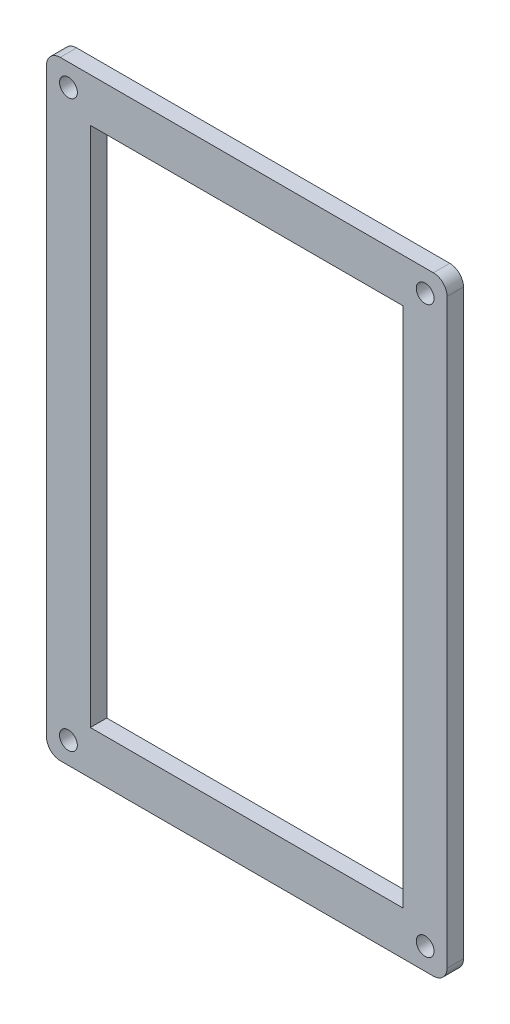
ISO-10303-21;
HEADER;
FILE_DESCRIPTION(('STEP AP214'),'2;1');
FILE_NAME('part.step','',(''),(''),'','','');
FILE_SCHEMA(('AUTOMOTIVE_DESIGN { 1 0 10303 214 1 1 1 1 }'));
ENDSEC;
DATA;
#1=APPLICATION_CONTEXT('core data for automotive mechanical design processes');
#2=APPLICATION_PROTOCOL_DEFINITION('international standard','automotive_design',2000,#1);
#3=PRODUCT_CONTEXT('',#1,'mechanical');
#4=PRODUCT('Part','Part','',(#3));
#5=PRODUCT_RELATED_PRODUCT_CATEGORY('part','',(#4));
#6=PRODUCT_DEFINITION_FORMATION('','',#4);
#7=PRODUCT_DEFINITION_CONTEXT('part definition',#1,'design');
#8=PRODUCT_DEFINITION('design','',#6,#7);
#9=PRODUCT_DEFINITION_SHAPE('','',#8);
#10=(LENGTH_UNIT() NAMED_UNIT(*) SI_UNIT(.MILLI.,.METRE.));
#11=(NAMED_UNIT(*) PLANE_ANGLE_UNIT() SI_UNIT($,.RADIAN.));
#12=(NAMED_UNIT(*) SI_UNIT($,.STERADIAN.) SOLID_ANGLE_UNIT());
#13=UNCERTAINTY_MEASURE_WITH_UNIT(LENGTH_MEASURE(1.E-05),#10,'distance_accuracy_value','');
#14=(GEOMETRIC_REPRESENTATION_CONTEXT(3) GLOBAL_UNCERTAINTY_ASSIGNED_CONTEXT((#13)) GLOBAL_UNIT_ASSIGNED_CONTEXT((#10,
#11,#12)) REPRESENTATION_CONTEXT('',''));
#15=CARTESIAN_POINT('',(0.,0.,0.));
#16=DIRECTION('',(0.,0.,1.));
#17=DIRECTION('',(1.,0.,0.));
#18=AXIS2_PLACEMENT_3D('',#15,#16,#17);
#19=CARTESIAN_POINT('',(0.,111.260961871699,3.));
#20=DIRECTION('',(0.,-1.,0.));
#21=DIRECTION('',(0.,0.,-1.));
#22=AXIS2_PLACEMENT_3D('',#19,#20,#21);
#23=PLANE('',#22);
#24=DIRECTION('',(-1.,0.,0.));
#25=VECTOR('',#24,1.);
#26=CARTESIAN_POINT('',(0.,111.260961871699,0.));
#27=LINE('',#26,#25);
#28=CARTESIAN_POINT('',(70.6730630130925,111.260961871699,0.));
#29=VERTEX_POINT('',#28);
#30=CARTESIAN_POINT('',(2.52284761309159,111.260961871699,0.));
#31=VERTEX_POINT('',#30);
#32=EDGE_CURVE('E179',#29,#31,#27,.T.);
#33=ORIENTED_EDGE('',*,*,#32,.T.);
#34=DIRECTION('',(0.,0.,-1.));
#35=VECTOR('',#34,1.);
#36=CARTESIAN_POINT('',(2.52284761309159,111.260961871699,3.));
#37=LINE('',#36,#35);
#38=CARTESIAN_POINT('',(2.52284761309159,111.260961871699,3.));
#39=VERTEX_POINT('',#38);
#40=EDGE_CURVE('E11',#39,#31,#37,.T.);
#41=ORIENTED_EDGE('',*,*,#40,.F.);
#42=DIRECTION('',(-1.,0.,0.));
#43=VECTOR('',#42,1.);
#44=CARTESIAN_POINT('',(0.,111.260961871699,3.));
#45=LINE('',#44,#43);
#46=CARTESIAN_POINT('',(70.6730630130925,111.260961871699,3.));
#47=VERTEX_POINT('',#46);
#48=EDGE_CURVE('E234',#47,#39,#45,.T.);
#49=ORIENTED_EDGE('',*,*,#48,.F.);
#50=DIRECTION('',(0.,0.,-1.));
#51=VECTOR('',#50,1.);
#52=CARTESIAN_POINT('',(70.6730630130925,111.260961871699,3.));
#53=LINE('',#52,#51);
#54=EDGE_CURVE('E199',#47,#29,#53,.T.);
#55=ORIENTED_EDGE('',*,*,#54,.T.);
#56=EDGE_LOOP('',(#33,#41,#49,#55));
#57=FACE_BOUND('',#56,.T.);
#58=ADVANCED_FACE('F33',(#57),#23,.F.);
#59=CARTESIAN_POINT('',(2.52284761309159,108.760961871699,3.));
#60=DIRECTION('',(0.,0.,-1.));
#61=DIRECTION('',(-1.,0.,0.));
#62=AXIS2_PLACEMENT_3D('',#59,#60,#61);
#63=CYLINDRICAL_SURFACE('',#62,2.5);
#64=CARTESIAN_POINT('',(2.52284761309159,108.760961871699,0.));
#65=DIRECTION('',(0.,0.,1.));
#66=DIRECTION('',(1.,0.,0.));
#67=AXIS2_PLACEMENT_3D('',#64,#65,#66);
#68=CIRCLE('',#67,2.5);
#69=CARTESIAN_POINT('',(0.0228476130915918,108.760961871699,0.));
#70=VERTEX_POINT('',#69);
#71=EDGE_CURVE('E182',#31,#70,#68,.T.);
#72=ORIENTED_EDGE('',*,*,#71,.T.);
#73=DIRECTION('',(0.,0.,-1.));
#74=VECTOR('',#73,1.);
#75=CARTESIAN_POINT('',(0.0228476130915918,108.760961871699,3.));
#76=LINE('',#75,#74);
#77=CARTESIAN_POINT('',(0.0228476130915918,108.760961871699,3.));
#78=VERTEX_POINT('',#77);
#79=EDGE_CURVE('E43',#78,#70,#76,.T.);
#80=ORIENTED_EDGE('',*,*,#79,.F.);
#81=CARTESIAN_POINT('',(2.52284761309159,108.760961871699,3.));
#82=DIRECTION('',(0.,0.,1.));
#83=DIRECTION('',(1.,0.,0.));
#84=AXIS2_PLACEMENT_3D('',#81,#82,#83);
#85=CIRCLE('',#84,2.5);
#86=EDGE_CURVE('E242',#39,#78,#85,.T.);
#87=ORIENTED_EDGE('',*,*,#86,.F.);
#88=ORIENTED_EDGE('',*,*,#40,.T.);
#89=EDGE_LOOP('',(#72,#80,#87,#88));
#90=FACE_BOUND('',#89,.T.);
#91=ADVANCED_FACE('F271',(#90),#63,.T.);
#92=CARTESIAN_POINT('',(0.0228476130915846,0.,3.));
#93=DIRECTION('',(-1.,0.,0.));
#94=DIRECTION('',(0.,-1.,0.));
#95=AXIS2_PLACEMENT_3D('',#92,#93,#94);
#96=PLANE('',#95);
#97=DIRECTION('',(0.,1.,0.));
#98=VECTOR('',#97,1.);
#99=CARTESIAN_POINT('',(0.0228476130915846,0.,0.));
#100=LINE('',#99,#98);
#101=CARTESIAN_POINT('',(0.0228476130915851,2.51115487169858,0.));
#102=VERTEX_POINT('',#101);
#103=EDGE_CURVE('E185',#102,#70,#100,.T.);
#104=ORIENTED_EDGE('',*,*,#103,.F.);
#105=DIRECTION('',(0.,0.,-1.));
#106=VECTOR('',#105,1.);
#107=CARTESIAN_POINT('',(0.0228476130915851,2.51115487169858,3.));
#108=LINE('',#107,#106);
#109=CARTESIAN_POINT('',(0.0228476130915851,2.51115487169858,3.));
#110=VERTEX_POINT('',#109);
#111=EDGE_CURVE('E205',#110,#102,#108,.T.);
#112=ORIENTED_EDGE('',*,*,#111,.F.);
#113=DIRECTION('',(0.,1.,0.));
#114=VECTOR('',#113,1.);
#115=CARTESIAN_POINT('',(0.0228476130915846,0.,3.));
#116=LINE('',#115,#114);
#117=EDGE_CURVE('E244',#110,#78,#116,.T.);
#118=ORIENTED_EDGE('',*,*,#117,.T.);
#119=ORIENTED_EDGE('',*,*,#79,.T.);
#120=EDGE_LOOP('',(#104,#112,#118,#119));
#121=FACE_BOUND('',#120,.T.);
#122=ADVANCED_FACE('F276',(#121),#96,.T.);
#123=CARTESIAN_POINT('',(2.52284761309159,2.51115487169858,3.));
#124=DIRECTION('',(0.,0.,-1.));
#125=DIRECTION('',(-1.,0.,0.));
#126=AXIS2_PLACEMENT_3D('',#123,#124,#125);
#127=CYLINDRICAL_SURFACE('',#126,2.5);
#128=CARTESIAN_POINT('',(2.52284761309159,2.51115487169858,0.));
#129=DIRECTION('',(0.,0.,1.));
#130=DIRECTION('',(1.,0.,0.));
#131=AXIS2_PLACEMENT_3D('',#128,#129,#130);
#132=CIRCLE('',#131,2.5);
#133=CARTESIAN_POINT('',(2.52284761309159,0.0111548716985808,0.));
#134=VERTEX_POINT('',#133);
#135=EDGE_CURVE('E188',#102,#134,#132,.T.);
#136=ORIENTED_EDGE('',*,*,#135,.T.);
#137=DIRECTION('',(0.,0.,-1.));
#138=VECTOR('',#137,1.);
#139=CARTESIAN_POINT('',(2.52284761309159,0.0111548716985808,3.));
#140=LINE('',#139,#138);
#141=CARTESIAN_POINT('',(2.52284761309159,0.0111548716985808,3.));
#142=VERTEX_POINT('',#141);
#143=EDGE_CURVE('E203',#142,#134,#140,.T.);
#144=ORIENTED_EDGE('',*,*,#143,.F.);
#145=CARTESIAN_POINT('',(2.52284761309159,2.51115487169858,3.));
#146=DIRECTION('',(0.,0.,1.));
#147=DIRECTION('',(1.,0.,0.));
#148=AXIS2_PLACEMENT_3D('',#145,#146,#147);
#149=CIRCLE('',#148,2.5);
#150=EDGE_CURVE('E247',#110,#142,#149,.T.);
#151=ORIENTED_EDGE('',*,*,#150,.F.);
#152=ORIENTED_EDGE('',*,*,#111,.T.);
#153=EDGE_LOOP('',(#136,#144,#151,#152));
#154=FACE_BOUND('',#153,.T.);
#155=ADVANCED_FACE('F397',(#154),#127,.T.);
#156=CARTESIAN_POINT('',(0.,0.011154871698581,3.));
#157=DIRECTION('',(0.,-1.,0.));
#158=DIRECTION('',(1.,0.,0.));
#159=AXIS2_PLACEMENT_3D('',#156,#157,#158);
#160=PLANE('',#159);
#161=DIRECTION('',(-1.,0.,0.));
#162=VECTOR('',#161,1.);
#163=CARTESIAN_POINT('',(0.,0.011154871698581,0.));
#164=LINE('',#163,#162);
#165=CARTESIAN_POINT('',(70.6730630130925,0.0111548716985741,0.));
#166=VERTEX_POINT('',#165);
#167=EDGE_CURVE('E191',#166,#134,#164,.T.);
#168=ORIENTED_EDGE('',*,*,#167,.F.);
#169=DIRECTION('',(0.,0.,-1.));
#170=VECTOR('',#169,1.);
#171=CARTESIAN_POINT('',(70.6730630130925,0.0111548716985741,3.));
#172=LINE('',#171,#170);
#173=CARTESIAN_POINT('',(70.6730630130925,0.0111548716985741,3.));
#174=VERTEX_POINT('',#173);
#175=EDGE_CURVE('E148',#174,#166,#172,.T.);
#176=ORIENTED_EDGE('',*,*,#175,.F.);
#177=DIRECTION('',(-1.,0.,0.));
#178=VECTOR('',#177,1.);
#179=CARTESIAN_POINT('',(0.,0.011154871698581,3.));
#180=LINE('',#179,#178);
#181=EDGE_CURVE('E137',#174,#142,#180,.T.);
#182=ORIENTED_EDGE('',*,*,#181,.T.);
#183=ORIENTED_EDGE('',*,*,#143,.T.);
#184=EDGE_LOOP('',(#168,#176,#182,#183));
#185=FACE_BOUND('',#184,.T.);
#186=ADVANCED_FACE('F250',(#185),#160,.T.);
#187=CARTESIAN_POINT('',(70.6730630130925,2.51115487169857,3.));
#188=DIRECTION('',(0.,0.,-1.));
#189=DIRECTION('',(-1.,0.,0.));
#190=AXIS2_PLACEMENT_3D('',#187,#188,#189);
#191=CYLINDRICAL_SURFACE('',#190,2.5);
#192=CARTESIAN_POINT('',(70.6730630130925,2.51115487169857,0.));
#193=DIRECTION('',(0.,0.,1.));
#194=DIRECTION('',(1.,0.,0.));
#195=AXIS2_PLACEMENT_3D('',#192,#193,#194);
#196=CIRCLE('',#195,2.5);
#197=CARTESIAN_POINT('',(73.1730630130925,2.51115487169857,0.));
#198=VERTEX_POINT('',#197);
#199=EDGE_CURVE('E144',#166,#198,#196,.T.);
#200=ORIENTED_EDGE('',*,*,#199,.T.);
#201=DIRECTION('',(0.,0.,-1.));
#202=VECTOR('',#201,1.);
#203=CARTESIAN_POINT('',(73.1730630130925,2.51115487169857,3.));
#204=LINE('',#203,#202);
#205=CARTESIAN_POINT('',(73.1730630130925,2.51115487169857,3.));
#206=VERTEX_POINT('',#205);
#207=EDGE_CURVE('E141',#206,#198,#204,.T.);
#208=ORIENTED_EDGE('',*,*,#207,.F.);
#209=CARTESIAN_POINT('',(70.6730630130925,2.51115487169857,3.));
#210=DIRECTION('',(0.,0.,1.));
#211=DIRECTION('',(1.,0.,0.));
#212=AXIS2_PLACEMENT_3D('',#209,#210,#211);
#213=CIRCLE('',#212,2.5);
#214=EDGE_CURVE('E131',#174,#206,#213,.T.);
#215=ORIENTED_EDGE('',*,*,#214,.F.);
#216=ORIENTED_EDGE('',*,*,#175,.T.);
#217=EDGE_LOOP('',(#200,#208,#215,#216));
#218=FACE_BOUND('',#217,.T.);
#219=ADVANCED_FACE('F142',(#218),#191,.T.);
#220=CARTESIAN_POINT('',(73.1730630130925,0.,3.));
#221=DIRECTION('',(1.,0.,0.));
#222=DIRECTION('',(0.,0.,-1.));
#223=AXIS2_PLACEMENT_3D('',#220,#221,#222);
#224=PLANE('',#223);
#225=DIRECTION('',(0.,-1.,0.));
#226=VECTOR('',#225,1.);
#227=CARTESIAN_POINT('',(73.1730630130925,0.,0.));
#228=LINE('',#227,#226);
#229=CARTESIAN_POINT('',(73.1730630130925,108.760961871699,0.));
#230=VERTEX_POINT('',#229);
#231=EDGE_CURVE('E195',#230,#198,#228,.T.);
#232=ORIENTED_EDGE('',*,*,#231,.F.);
#233=DIRECTION('',(0.,0.,-1.));
#234=VECTOR('',#233,1.);
#235=CARTESIAN_POINT('',(73.1730630130925,108.760961871699,3.));
#236=LINE('',#235,#234);
#237=CARTESIAN_POINT('',(73.1730630130925,108.760961871699,3.));
#238=VERTEX_POINT('',#237);
#239=EDGE_CURVE('E92',#238,#230,#236,.T.);
#240=ORIENTED_EDGE('',*,*,#239,.F.);
#241=DIRECTION('',(0.,-1.,0.));
#242=VECTOR('',#241,1.);
#243=CARTESIAN_POINT('',(73.1730630130925,0.,3.));
#244=LINE('',#243,#242);
#245=EDGE_CURVE('E135',#238,#206,#244,.T.);
#246=ORIENTED_EDGE('',*,*,#245,.T.);
#247=ORIENTED_EDGE('',*,*,#207,.T.);
#248=EDGE_LOOP('',(#232,#240,#246,#247));
#249=FACE_BOUND('',#248,.T.);
#250=ADVANCED_FACE('F150',(#249),#224,.T.);
#251=CARTESIAN_POINT('',(65.1730630130925,0.,3.));
#252=DIRECTION('',(1.,0.,0.));
#253=DIRECTION('',(0.,0.,-1.));
#254=AXIS2_PLACEMENT_3D('',#251,#252,#253);
#255=PLANE('',#254);
#256=DIRECTION('',(0.,-1.,0.));
#257=VECTOR('',#256,1.);
#258=CARTESIAN_POINT('',(65.1730630130925,0.,0.));
#259=LINE('',#258,#257);
#260=CARTESIAN_POINT('',(65.1730630130925,103.260961871699,0.));
#261=VERTEX_POINT('',#260);
#262=CARTESIAN_POINT('',(65.1730630130925,8.01115487169857,0.));
#263=VERTEX_POINT('',#262);
#264=EDGE_CURVE('E168',#261,#263,#259,.T.);
#265=ORIENTED_EDGE('',*,*,#264,.T.);
#266=DIRECTION('',(0.,0.,-1.));
#267=VECTOR('',#266,1.);
#268=CARTESIAN_POINT('',(65.1730630130925,8.01115487169857,3.));
#269=LINE('',#268,#267);
#270=CARTESIAN_POINT('',(65.1730630130925,8.01115487169857,3.));
#271=VERTEX_POINT('',#270);
#272=EDGE_CURVE('E37',#271,#263,#269,.T.);
#273=ORIENTED_EDGE('',*,*,#272,.F.);
#274=DIRECTION('',(0.,-1.,0.));
#275=VECTOR('',#274,1.);
#276=CARTESIAN_POINT('',(65.1730630130925,0.,3.));
#277=LINE('',#276,#275);
#278=CARTESIAN_POINT('',(65.1730630130925,103.260961871699,3.));
#279=VERTEX_POINT('',#278);
#280=EDGE_CURVE('E237',#279,#271,#277,.T.);
#281=ORIENTED_EDGE('',*,*,#280,.F.);
#282=DIRECTION('',(0.,0.,-1.));
#283=VECTOR('',#282,1.);
#284=CARTESIAN_POINT('',(65.1730630130925,103.260961871699,3.));
#285=LINE('',#284,#283);
#286=EDGE_CURVE('E152',#279,#261,#285,.T.);
#287=ORIENTED_EDGE('',*,*,#286,.T.);
#288=EDGE_LOOP('',(#265,#273,#281,#287));
#289=FACE_BOUND('',#288,.T.);
#290=ADVANCED_FACE('F220',(#289),#255,.F.);
#291=CARTESIAN_POINT('',(0.,8.01115487169858,3.));
#292=DIRECTION('',(0.,-1.,0.));
#293=DIRECTION('',(1.,0.,0.));
#294=AXIS2_PLACEMENT_3D('',#291,#292,#293);
#295=PLANE('',#294);
#296=DIRECTION('',(-1.,0.,0.));
#297=VECTOR('',#296,1.);
#298=CARTESIAN_POINT('',(0.,8.01115487169858,0.));
#299=LINE('',#298,#297);
#300=CARTESIAN_POINT('',(8.02284761309159,8.01115487169858,0.));
#301=VERTEX_POINT('',#300);
#302=EDGE_CURVE('E171',#263,#301,#299,.T.);
#303=ORIENTED_EDGE('',*,*,#302,.T.);
#304=DIRECTION('',(0.,0.,-1.));
#305=VECTOR('',#304,1.);
#306=CARTESIAN_POINT('',(8.02284761309159,8.01115487169858,3.));
#307=LINE('',#306,#305);
#308=CARTESIAN_POINT('',(8.02284761309159,8.01115487169858,3.));
#309=VERTEX_POINT('',#308);
#310=EDGE_CURVE('E211',#309,#301,#307,.T.);
#311=ORIENTED_EDGE('',*,*,#310,.F.);
#312=DIRECTION('',(-1.,0.,0.));
#313=VECTOR('',#312,1.);
#314=CARTESIAN_POINT('',(0.,8.01115487169858,3.));
#315=LINE('',#314,#313);
#316=EDGE_CURVE('E104',#271,#309,#315,.T.);
#317=ORIENTED_EDGE('',*,*,#316,.F.);
#318=ORIENTED_EDGE('',*,*,#272,.T.);
#319=EDGE_LOOP('',(#303,#311,#317,#318));
#320=FACE_BOUND('',#319,.T.);
#321=ADVANCED_FACE('F216',(#320),#295,.F.);
#322=CARTESIAN_POINT('',(8.02284761309159,0.,3.));
#323=DIRECTION('',(1.,0.,0.));
#324=DIRECTION('',(0.,0.,-1.));
#325=AXIS2_PLACEMENT_3D('',#322,#323,#324);
#326=PLANE('',#325);
#327=DIRECTION('',(0.,-1.,0.));
#328=VECTOR('',#327,1.);
#329=CARTESIAN_POINT('',(8.02284761309159,0.,0.));
#330=LINE('',#329,#328);
#331=CARTESIAN_POINT('',(8.02284761309159,103.260961871699,0.));
#332=VERTEX_POINT('',#331);
#333=EDGE_CURVE('E174',#332,#301,#330,.T.);
#334=ORIENTED_EDGE('',*,*,#333,.F.);
#335=DIRECTION('',(0.,0.,-1.));
#336=VECTOR('',#335,1.);
#337=CARTESIAN_POINT('',(8.02284761309159,103.260961871699,3.));
#338=LINE('',#337,#336);
#339=CARTESIAN_POINT('',(8.02284761309159,103.260961871699,3.));
#340=VERTEX_POINT('',#339);
#341=EDGE_CURVE('E210',#340,#332,#338,.T.);
#342=ORIENTED_EDGE('',*,*,#341,.F.);
#343=DIRECTION('',(0.,-1.,0.));
#344=VECTOR('',#343,1.);
#345=CARTESIAN_POINT('',(8.02284761309159,0.,3.));
#346=LINE('',#345,#344);
#347=EDGE_CURVE('E229',#340,#309,#346,.T.);
#348=ORIENTED_EDGE('',*,*,#347,.T.);
#349=ORIENTED_EDGE('',*,*,#310,.T.);
#350=EDGE_LOOP('',(#334,#342,#348,#349));
#351=FACE_BOUND('',#350,.T.);
#352=ADVANCED_FACE('F226',(#351),#326,.T.);
#353=CARTESIAN_POINT('',(0.,103.260961871699,3.));
#354=DIRECTION('',(0.,1.,0.));
#355=DIRECTION('',(-1.,0.,0.));
#356=AXIS2_PLACEMENT_3D('',#353,#354,#355);
#357=PLANE('',#356);
#358=DIRECTION('',(1.,0.,0.));
#359=VECTOR('',#358,1.);
#360=CARTESIAN_POINT('',(0.,103.260961871699,0.));
#361=LINE('',#360,#359);
#362=EDGE_CURVE('E177',#332,#261,#361,.T.);
#363=ORIENTED_EDGE('',*,*,#362,.T.);
#364=ORIENTED_EDGE('',*,*,#286,.F.);
#365=DIRECTION('',(1.,0.,0.));
#366=VECTOR('',#365,1.);
#367=CARTESIAN_POINT('',(0.,103.260961871699,3.));
#368=LINE('',#367,#366);
#369=EDGE_CURVE('E231',#340,#279,#368,.T.);
#370=ORIENTED_EDGE('',*,*,#369,.F.);
#371=ORIENTED_EDGE('',*,*,#341,.T.);
#372=EDGE_LOOP('',(#363,#364,#370,#371));
#373=FACE_BOUND('',#372,.T.);
#374=ADVANCED_FACE('F232',(#373),#357,.F.);
#375=CARTESIAN_POINT('',(69.1730630130925,107.260961871699,3.));
#376=DIRECTION('',(0.,0.,-1.));
#377=DIRECTION('',(-1.,0.,0.));
#378=AXIS2_PLACEMENT_3D('',#375,#376,#377);
#379=CYLINDRICAL_SURFACE('',#378,1.625);
#380=CARTESIAN_POINT('',(69.1730630130925,107.260961871699,3.));
#381=DIRECTION('',(0.,0.,1.));
#382=DIRECTION('',(1.,0.,0.));
#383=AXIS2_PLACEMENT_3D('',#380,#381,#382);
#384=CIRCLE('',#383,1.625);
#385=CARTESIAN_POINT('',(70.7980630130925,107.260961871699,3.));
#386=VERTEX_POINT('',#385);
#387=EDGE_CURVE('E449',#386,#386,#384,.T.);
#388=ORIENTED_EDGE('',*,*,#387,.T.);
#389=EDGE_LOOP('',(#388));
#390=FACE_BOUND('',#389,.T.);
#391=CARTESIAN_POINT('',(69.1730630130925,107.260961871699,0.));
#392=DIRECTION('',(0.,0.,1.));
#393=DIRECTION('',(1.,0.,0.));
#394=AXIS2_PLACEMENT_3D('',#391,#392,#393);
#395=CIRCLE('',#394,1.625);
#396=CARTESIAN_POINT('',(70.7980630130925,107.260961871699,0.));
#397=VERTEX_POINT('',#396);
#398=EDGE_CURVE('E165',#397,#397,#395,.T.);
#399=ORIENTED_EDGE('',*,*,#398,.F.);
#400=EDGE_LOOP('',(#399));
#401=FACE_BOUND('',#400,.T.);
#402=ADVANCED_FACE('F283',(#390,#401),#379,.F.);
#403=CARTESIAN_POINT('',(4.02284761309159,107.260961871699,3.));
#404=DIRECTION('',(0.,0.,-1.));
#405=DIRECTION('',(-1.,0.,0.));
#406=AXIS2_PLACEMENT_3D('',#403,#404,#405);
#407=CYLINDRICAL_SURFACE('',#406,1.625);
#408=CARTESIAN_POINT('',(4.02284761309159,107.260961871699,3.));
#409=DIRECTION('',(0.,0.,1.));
#410=DIRECTION('',(1.,0.,0.));
#411=AXIS2_PLACEMENT_3D('',#408,#409,#410);
#412=CIRCLE('',#411,1.625);
#413=CARTESIAN_POINT('',(5.64784761309159,107.260961871699,3.));
#414=VERTEX_POINT('',#413);
#415=EDGE_CURVE('E446',#414,#414,#412,.T.);
#416=ORIENTED_EDGE('',*,*,#415,.T.);
#417=EDGE_LOOP('',(#416));
#418=FACE_BOUND('',#417,.T.);
#419=CARTESIAN_POINT('',(4.02284761309159,107.260961871699,0.));
#420=DIRECTION('',(0.,0.,1.));
#421=DIRECTION('',(1.,0.,0.));
#422=AXIS2_PLACEMENT_3D('',#419,#420,#421);
#423=CIRCLE('',#422,1.625);
#424=CARTESIAN_POINT('',(5.64784761309159,107.260961871699,0.));
#425=VERTEX_POINT('',#424);
#426=EDGE_CURVE('E162',#425,#425,#423,.T.);
#427=ORIENTED_EDGE('',*,*,#426,.F.);
#428=EDGE_LOOP('',(#427));
#429=FACE_BOUND('',#428,.T.);
#430=ADVANCED_FACE('F292',(#418,#429),#407,.F.);
#431=CARTESIAN_POINT('',(4.02284761309159,4.01115487169858,3.));
#432=DIRECTION('',(0.,0.,-1.));
#433=DIRECTION('',(-1.,0.,0.));
#434=AXIS2_PLACEMENT_3D('',#431,#432,#433);
#435=CYLINDRICAL_SURFACE('',#434,1.625);
#436=CARTESIAN_POINT('',(4.02284761309159,4.01115487169858,3.));
#437=DIRECTION('',(0.,0.,1.));
#438=DIRECTION('',(1.,0.,0.));
#439=AXIS2_PLACEMENT_3D('',#436,#437,#438);
#440=CIRCLE('',#439,1.625);
#441=CARTESIAN_POINT('',(5.64784761309159,4.01115487169858,3.));
#442=VERTEX_POINT('',#441);
#443=EDGE_CURVE('E303',#442,#442,#440,.T.);
#444=ORIENTED_EDGE('',*,*,#443,.T.);
#445=EDGE_LOOP('',(#444));
#446=FACE_BOUND('',#445,.T.);
#447=CARTESIAN_POINT('',(4.02284761309159,4.01115487169858,0.));
#448=DIRECTION('',(0.,0.,1.));
#449=DIRECTION('',(1.,0.,0.));
#450=AXIS2_PLACEMENT_3D('',#447,#448,#449);
#451=CIRCLE('',#450,1.625);
#452=CARTESIAN_POINT('',(5.64784761309159,4.01115487169858,0.));
#453=VERTEX_POINT('',#452);
#454=EDGE_CURVE('E159',#453,#453,#451,.T.);
#455=ORIENTED_EDGE('',*,*,#454,.F.);
#456=EDGE_LOOP('',(#455));
#457=FACE_BOUND('',#456,.T.);
#458=ADVANCED_FACE('F266',(#446,#457),#435,.F.);
#459=CARTESIAN_POINT('',(69.1730630130925,4.01115487169858,3.));
#460=DIRECTION('',(0.,0.,-1.));
#461=DIRECTION('',(-1.,0.,0.));
#462=AXIS2_PLACEMENT_3D('',#459,#460,#461);
#463=CYLINDRICAL_SURFACE('',#462,1.625);
#464=CARTESIAN_POINT('',(69.1730630130925,4.01115487169858,3.));
#465=DIRECTION('',(0.,0.,1.));
#466=DIRECTION('',(1.,0.,0.));
#467=AXIS2_PLACEMENT_3D('',#464,#465,#466);
#468=CIRCLE('',#467,1.625);
#469=CARTESIAN_POINT('',(70.7980630130925,4.01115487169858,3.));
#470=VERTEX_POINT('',#469);
#471=EDGE_CURVE('E198',#470,#470,#468,.T.);
#472=ORIENTED_EDGE('',*,*,#471,.T.);
#473=EDGE_LOOP('',(#472));
#474=FACE_BOUND('',#473,.T.);
#475=CARTESIAN_POINT('',(69.1730630130925,4.01115487169858,0.));
#476=DIRECTION('',(0.,0.,1.));
#477=DIRECTION('',(1.,0.,0.));
#478=AXIS2_PLACEMENT_3D('',#475,#476,#477);
#479=CIRCLE('',#478,1.625);
#480=CARTESIAN_POINT('',(70.7980630130925,4.01115487169858,0.));
#481=VERTEX_POINT('',#480);
#482=EDGE_CURVE('E156',#481,#481,#479,.T.);
#483=ORIENTED_EDGE('',*,*,#482,.F.);
#484=EDGE_LOOP('',(#483));
#485=FACE_BOUND('',#484,.T.);
#486=ADVANCED_FACE('F35',(#474,#485),#463,.F.);
#487=CARTESIAN_POINT('',(70.6730630130925,108.760961871699,3.));
#488=DIRECTION('',(0.,0.,-1.));
#489=DIRECTION('',(-1.,0.,0.));
#490=AXIS2_PLACEMENT_3D('',#487,#488,#489);
#491=CYLINDRICAL_SURFACE('',#490,2.5);
#492=CARTESIAN_POINT('',(70.6730630130925,108.760961871699,0.));
#493=DIRECTION('',(0.,0.,1.));
#494=DIRECTION('',(1.,0.,0.));
#495=AXIS2_PLACEMENT_3D('',#492,#493,#494);
#496=CIRCLE('',#495,2.5);
#497=EDGE_CURVE('E95',#230,#29,#496,.T.);
#498=ORIENTED_EDGE('',*,*,#497,.T.);
#499=ORIENTED_EDGE('',*,*,#54,.F.);
#500=CARTESIAN_POINT('',(70.6730630130925,108.760961871699,3.));
#501=DIRECTION('',(0.,0.,1.));
#502=DIRECTION('',(1.,0.,0.));
#503=AXIS2_PLACEMENT_3D('',#500,#501,#502);
#504=CIRCLE('',#503,2.5);
#505=EDGE_CURVE('E52',#238,#47,#504,.T.);
#506=ORIENTED_EDGE('',*,*,#505,.F.);
#507=ORIENTED_EDGE('',*,*,#239,.T.);
#508=EDGE_LOOP('',(#498,#499,#506,#507));
#509=FACE_BOUND('',#508,.T.);
#510=ADVANCED_FACE('F257',(#509),#491,.T.);
#511=CARTESIAN_POINT('',(0.,0.,3.));
#512=DIRECTION('',(0.,0.,1.));
#513=DIRECTION('',(1.,0.,0.));
#514=AXIS2_PLACEMENT_3D('',#511,#512,#513);
#515=PLANE('',#514);
#516=ORIENTED_EDGE('',*,*,#471,.F.);
#517=EDGE_LOOP('',(#516));
#518=FACE_BOUND('',#517,.T.);
#519=ORIENTED_EDGE('',*,*,#443,.F.);
#520=EDGE_LOOP('',(#519));
#521=FACE_BOUND('',#520,.T.);
#522=ORIENTED_EDGE('',*,*,#415,.F.);
#523=EDGE_LOOP('',(#522));
#524=FACE_BOUND('',#523,.T.);
#525=ORIENTED_EDGE('',*,*,#387,.F.);
#526=EDGE_LOOP('',(#525));
#527=FACE_BOUND('',#526,.T.);
#528=ORIENTED_EDGE('',*,*,#280,.T.);
#529=ORIENTED_EDGE('',*,*,#316,.T.);
#530=ORIENTED_EDGE('',*,*,#347,.F.);
#531=ORIENTED_EDGE('',*,*,#369,.T.);
#532=EDGE_LOOP('',(#528,#529,#530,#531));
#533=FACE_BOUND('',#532,.T.);
#534=ORIENTED_EDGE('',*,*,#48,.T.);
#535=ORIENTED_EDGE('',*,*,#86,.T.);
#536=ORIENTED_EDGE('',*,*,#117,.F.);
#537=ORIENTED_EDGE('',*,*,#150,.T.);
#538=ORIENTED_EDGE('',*,*,#181,.F.);
#539=ORIENTED_EDGE('',*,*,#214,.T.);
#540=ORIENTED_EDGE('',*,*,#245,.F.);
#541=ORIENTED_EDGE('',*,*,#505,.T.);
#542=EDGE_LOOP('',(#534,#535,#536,#537,#538,#539,#540,#541));
#543=FACE_BOUND('',#542,.T.);
#544=ADVANCED_FACE('F133',(#518,#521,#524,#527,#533,#543),#515,.T.);
#545=CARTESIAN_POINT('',(0.,0.,0.));
#546=DIRECTION('',(0.,0.,1.));
#547=DIRECTION('',(1.,0.,0.));
#548=AXIS2_PLACEMENT_3D('',#545,#546,#547);
#549=PLANE('',#548);
#550=ORIENTED_EDGE('',*,*,#482,.T.);
#551=EDGE_LOOP('',(#550));
#552=FACE_BOUND('',#551,.T.);
#553=ORIENTED_EDGE('',*,*,#454,.T.);
#554=EDGE_LOOP('',(#553));
#555=FACE_BOUND('',#554,.T.);
#556=ORIENTED_EDGE('',*,*,#426,.T.);
#557=EDGE_LOOP('',(#556));
#558=FACE_BOUND('',#557,.T.);
#559=ORIENTED_EDGE('',*,*,#398,.T.);
#560=EDGE_LOOP('',(#559));
#561=FACE_BOUND('',#560,.T.);
#562=ORIENTED_EDGE('',*,*,#264,.F.);
#563=ORIENTED_EDGE('',*,*,#362,.F.);
#564=ORIENTED_EDGE('',*,*,#333,.T.);
#565=ORIENTED_EDGE('',*,*,#302,.F.);
#566=EDGE_LOOP('',(#562,#563,#564,#565));
#567=FACE_BOUND('',#566,.T.);
#568=ORIENTED_EDGE('',*,*,#32,.F.);
#569=ORIENTED_EDGE('',*,*,#497,.F.);
#570=ORIENTED_EDGE('',*,*,#231,.T.);
#571=ORIENTED_EDGE('',*,*,#199,.F.);
#572=ORIENTED_EDGE('',*,*,#167,.T.);
#573=ORIENTED_EDGE('',*,*,#135,.F.);
#574=ORIENTED_EDGE('',*,*,#103,.T.);
#575=ORIENTED_EDGE('',*,*,#71,.F.);
#576=EDGE_LOOP('',(#568,#569,#570,#571,#572,#573,#574,#575));
#577=FACE_BOUND('',#576,.T.);
#578=ADVANCED_FACE('F224',(#552,#555,#558,#561,#567,#577),#549,.F.);
#579=CLOSED_SHELL('',(#58,#91,#122,#155,#186,#219,#250,#290,#321,#352,#374,#402,#430,#458,#486,
#510,#544,#578));
#580=MANIFOLD_SOLID_BREP('B2',#579);
#581=ADVANCED_BREP_SHAPE_REPRESENTATION('',(#18,#580),#14);
#582=SHAPE_DEFINITION_REPRESENTATION(#9,#581);
ENDSEC;
END-ISO-10303-21;
